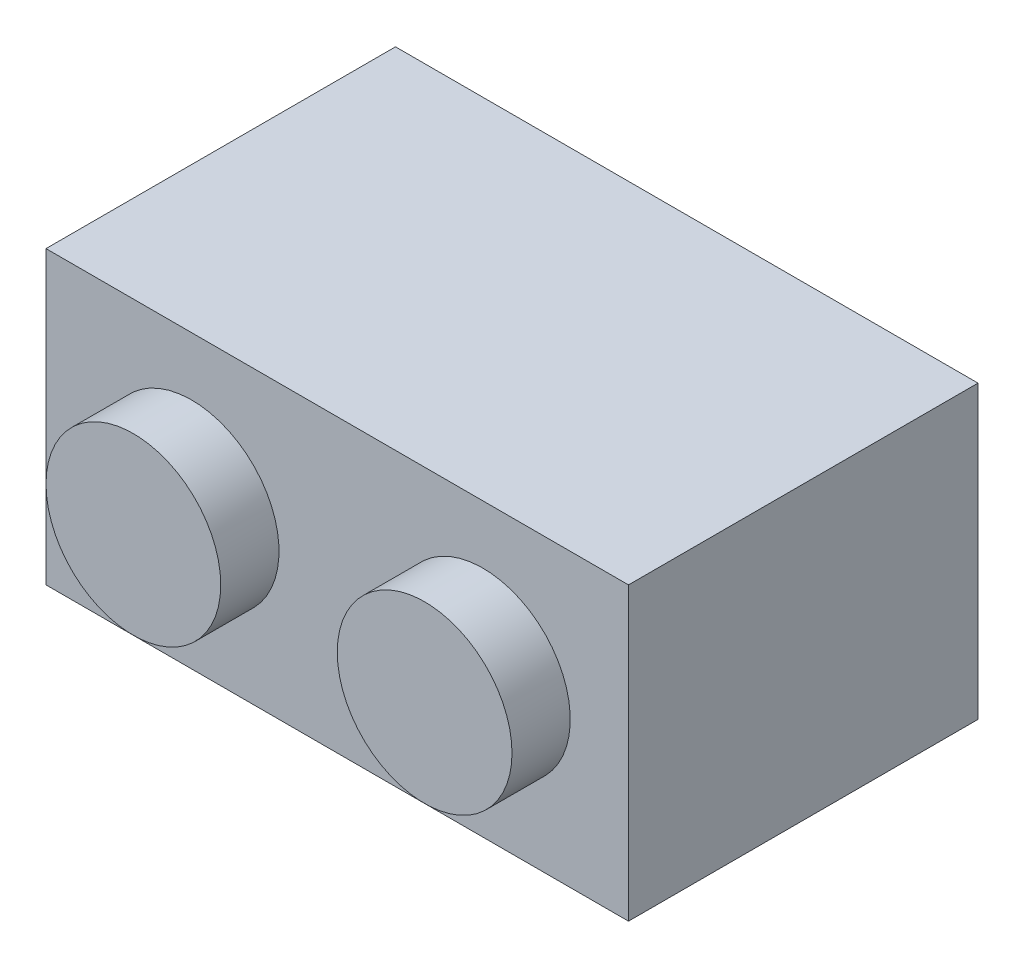
ISO-10303-21;
HEADER;
FILE_DESCRIPTION(('STEP AP214'),'2;1');
FILE_NAME('part.step','',(''),(''),'','','');
FILE_SCHEMA(('AUTOMOTIVE_DESIGN { 1 0 10303 214 1 1 1 1 }'));
ENDSEC;
DATA;
#1=APPLICATION_CONTEXT('core data for automotive mechanical design processes');
#2=APPLICATION_PROTOCOL_DEFINITION('international standard','automotive_design',2000,#1);
#3=PRODUCT_CONTEXT('',#1,'mechanical');
#4=PRODUCT('Part','Part','',(#3));
#5=PRODUCT_RELATED_PRODUCT_CATEGORY('part','',(#4));
#6=PRODUCT_DEFINITION_FORMATION('','',#4);
#7=PRODUCT_DEFINITION_CONTEXT('part definition',#1,'design');
#8=PRODUCT_DEFINITION('design','',#6,#7);
#9=PRODUCT_DEFINITION_SHAPE('','',#8);
#10=(LENGTH_UNIT() NAMED_UNIT(*) SI_UNIT(.MILLI.,.METRE.));
#11=(NAMED_UNIT(*) PLANE_ANGLE_UNIT() SI_UNIT($,.RADIAN.));
#12=(NAMED_UNIT(*) SI_UNIT($,.STERADIAN.) SOLID_ANGLE_UNIT());
#13=UNCERTAINTY_MEASURE_WITH_UNIT(LENGTH_MEASURE(1.E-05),#10,'distance_accuracy_value','');
#14=(GEOMETRIC_REPRESENTATION_CONTEXT(3) GLOBAL_UNCERTAINTY_ASSIGNED_CONTEXT((#13)) GLOBAL_UNIT_ASSIGNED_CONTEXT((#10,
#11,#12)) REPRESENTATION_CONTEXT('',''));
#15=CARTESIAN_POINT('',(0.,0.,0.));
#16=DIRECTION('',(0.,0.,1.));
#17=DIRECTION('',(1.,0.,0.));
#18=AXIS2_PLACEMENT_3D('',#15,#16,#17);
#19=CARTESIAN_POINT('',(0.,0.,7.9375));
#20=DIRECTION('',(0.,0.,-1.));
#21=DIRECTION('',(-1.,0.,0.));
#22=AXIS2_PLACEMENT_3D('',#19,#20,#21);
#23=PLANE('',#22);
#24=CARTESIAN_POINT('',(11.90625,3.96875,7.9375));
#25=DIRECTION('',(0.,0.,-1.));
#26=DIRECTION('',(-1.,0.,0.));
#27=AXIS2_PLACEMENT_3D('',#24,#25,#26);
#28=CIRCLE('',#27,0.793750000000002);
#29=CARTESIAN_POINT('',(11.1125,3.96875,7.9375));
#30=VERTEX_POINT('',#29);
#31=EDGE_CURVE('E132',#30,#30,#28,.F.);
#32=ORIENTED_EDGE('',*,*,#31,.T.);
#33=EDGE_LOOP('',(#32));
#34=FACE_BOUND('',#33,.T.);
#35=DIRECTION('',(0.,1.,0.));
#36=VECTOR('',#35,1.);
#37=CARTESIAN_POINT('',(1.5875,0.,7.9375));
#38=LINE('',#37,#36);
#39=CARTESIAN_POINT('',(1.5875,1.5875,7.9375));
#40=VERTEX_POINT('',#39);
#41=CARTESIAN_POINT('',(1.5875,6.35,7.9375));
#42=VERTEX_POINT('',#41);
#43=EDGE_CURVE('E128',#40,#42,#38,.T.);
#44=ORIENTED_EDGE('',*,*,#43,.T.);
#45=DIRECTION('',(1.,0.,0.));
#46=VECTOR('',#45,1.);
#47=CARTESIAN_POINT('',(0.,6.35,7.9375));
#48=LINE('',#47,#46);
#49=CARTESIAN_POINT('',(14.2875,6.35,7.9375));
#50=VERTEX_POINT('',#49);
#51=EDGE_CURVE('E126',#42,#50,#48,.T.);
#52=ORIENTED_EDGE('',*,*,#51,.T.);
#53=DIRECTION('',(0.,1.,0.));
#54=VECTOR('',#53,1.);
#55=CARTESIAN_POINT('',(14.2875,0.,7.9375));
#56=LINE('',#55,#54);
#57=CARTESIAN_POINT('',(14.2875,1.5875,7.9375));
#58=VERTEX_POINT('',#57);
#59=EDGE_CURVE('E117',#58,#50,#56,.T.);
#60=ORIENTED_EDGE('',*,*,#59,.F.);
#61=DIRECTION('',(1.,0.,0.));
#62=VECTOR('',#61,1.);
#63=CARTESIAN_POINT('',(0.,1.5875,7.9375));
#64=LINE('',#63,#62);
#65=EDGE_CURVE('E106',#40,#58,#64,.T.);
#66=ORIENTED_EDGE('',*,*,#65,.F.);
#67=EDGE_LOOP('',(#44,#52,#60,#66));
#68=FACE_BOUND('',#67,.T.);
#69=CARTESIAN_POINT('',(3.96875,3.96875,7.9375));
#70=DIRECTION('',(0.,0.,-1.));
#71=DIRECTION('',(-1.,0.,0.));
#72=AXIS2_PLACEMENT_3D('',#69,#70,#71);
#73=CIRCLE('',#72,0.793750000000002);
#74=CARTESIAN_POINT('',(3.175,3.96875,7.9375));
#75=VERTEX_POINT('',#74);
#76=EDGE_CURVE('E136',#75,#75,#73,.F.);
#77=ORIENTED_EDGE('',*,*,#76,.T.);
#78=EDGE_LOOP('',(#77));
#79=FACE_BOUND('',#78,.T.);
#80=CARTESIAN_POINT('',(7.9375,3.96875,7.9375));
#81=DIRECTION('',(0.,0.,-1.));
#82=DIRECTION('',(-1.,0.,0.));
#83=AXIS2_PLACEMENT_3D('',#80,#81,#82);
#84=CIRCLE('',#83,1.5875);
#85=CARTESIAN_POINT('',(6.35,3.96875,7.9375));
#86=VERTEX_POINT('',#85);
#87=EDGE_CURVE('E267',#86,#86,#84,.T.);
#88=ORIENTED_EDGE('',*,*,#87,.F.);
#89=EDGE_LOOP('',(#88));
#90=FACE_BOUND('',#89,.T.);
#91=ADVANCED_FACE('F33',(#34,#68,#79,#90),#23,.T.);
#92=CARTESIAN_POINT('',(0.,0.,9.525));
#93=DIRECTION('',(0.,0.,-1.));
#94=DIRECTION('',(-1.,0.,0.));
#95=AXIS2_PLACEMENT_3D('',#92,#93,#94);
#96=PLANE('',#95);
#97=CARTESIAN_POINT('',(3.96875,3.96875,9.525));
#98=DIRECTION('',(0.,0.,-1.));
#99=DIRECTION('',(-1.,0.,0.));
#100=AXIS2_PLACEMENT_3D('',#97,#98,#99);
#101=CIRCLE('',#100,2.38125);
#102=CARTESIAN_POINT('',(1.5875,3.96875,9.525));
#103=VERTEX_POINT('',#102);
#104=EDGE_CURVE('E41',#103,#103,#101,.F.);
#105=ORIENTED_EDGE('',*,*,#104,.F.);
#106=EDGE_LOOP('',(#105));
#107=FACE_BOUND('',#106,.T.);
#108=DIRECTION('',(0.,1.,0.));
#109=VECTOR('',#108,1.);
#110=CARTESIAN_POINT('',(0.,0.,9.525));
#111=LINE('',#110,#109);
#112=CARTESIAN_POINT('',(0.,0.,9.525));
#113=VERTEX_POINT('',#112);
#114=CARTESIAN_POINT('',(0.,7.9375,9.525));
#115=VERTEX_POINT('',#114);
#116=EDGE_CURVE('E162',#113,#115,#111,.T.);
#117=ORIENTED_EDGE('',*,*,#116,.F.);
#118=DIRECTION('',(1.,0.,0.));
#119=VECTOR('',#118,1.);
#120=CARTESIAN_POINT('',(0.,0.,9.525));
#121=LINE('',#120,#119);
#122=CARTESIAN_POINT('',(15.875,0.,9.525));
#123=VERTEX_POINT('',#122);
#124=EDGE_CURVE('E169',#113,#123,#121,.T.);
#125=ORIENTED_EDGE('',*,*,#124,.T.);
#126=DIRECTION('',(0.,1.,0.));
#127=VECTOR('',#126,1.);
#128=CARTESIAN_POINT('',(15.875,0.,9.525));
#129=LINE('',#128,#127);
#130=CARTESIAN_POINT('',(15.875,7.9375,9.525));
#131=VERTEX_POINT('',#130);
#132=EDGE_CURVE('E167',#123,#131,#129,.T.);
#133=ORIENTED_EDGE('',*,*,#132,.T.);
#134=DIRECTION('',(1.,0.,0.));
#135=VECTOR('',#134,1.);
#136=CARTESIAN_POINT('',(0.,7.9375,9.525));
#137=LINE('',#136,#135);
#138=EDGE_CURVE('E164',#115,#131,#137,.T.);
#139=ORIENTED_EDGE('',*,*,#138,.F.);
#140=EDGE_LOOP('',(#117,#125,#133,#139));
#141=FACE_BOUND('',#140,.T.);
#142=CARTESIAN_POINT('',(11.90625,3.96875,9.525));
#143=DIRECTION('',(0.,0.,-1.));
#144=DIRECTION('',(-1.,0.,0.));
#145=AXIS2_PLACEMENT_3D('',#142,#143,#144);
#146=CIRCLE('',#145,2.38125);
#147=CARTESIAN_POINT('',(9.525,3.96875,9.525));
#148=VERTEX_POINT('',#147);
#149=EDGE_CURVE('E11',#148,#148,#146,.F.);
#150=ORIENTED_EDGE('',*,*,#149,.F.);
#151=EDGE_LOOP('',(#150));
#152=FACE_BOUND('',#151,.T.);
#153=ADVANCED_FACE('F191',(#107,#141,#152),#96,.F.);
#154=CARTESIAN_POINT('',(0.,0.,9.525));
#155=DIRECTION('',(-1.,0.,0.));
#156=DIRECTION('',(0.,0.,1.));
#157=AXIS2_PLACEMENT_3D('',#154,#155,#156);
#158=PLANE('',#157);
#159=DIRECTION('',(0.,1.,0.));
#160=VECTOR('',#159,1.);
#161=CARTESIAN_POINT('',(0.,0.,0.));
#162=LINE('',#161,#160);
#163=CARTESIAN_POINT('',(0.,0.,0.));
#164=VERTEX_POINT('',#163);
#165=CARTESIAN_POINT('',(0.,7.9375,0.));
#166=VERTEX_POINT('',#165);
#167=EDGE_CURVE('E161',#164,#166,#162,.T.);
#168=ORIENTED_EDGE('',*,*,#167,.F.);
#169=DIRECTION('',(0.,0.,-1.));
#170=VECTOR('',#169,1.);
#171=CARTESIAN_POINT('',(0.,0.,9.525));
#172=LINE('',#171,#170);
#173=EDGE_CURVE('E57',#113,#164,#172,.T.);
#174=ORIENTED_EDGE('',*,*,#173,.F.);
#175=ORIENTED_EDGE('',*,*,#116,.T.);
#176=DIRECTION('',(0.,0.,-1.));
#177=VECTOR('',#176,1.);
#178=CARTESIAN_POINT('',(0.,7.9375,9.525));
#179=LINE('',#178,#177);
#180=EDGE_CURVE('E82',#115,#166,#179,.T.);
#181=ORIENTED_EDGE('',*,*,#180,.T.);
#182=EDGE_LOOP('',(#168,#174,#175,#181));
#183=FACE_BOUND('',#182,.T.);
#184=ADVANCED_FACE('F35',(#183),#158,.T.);
#185=CARTESIAN_POINT('',(0.,0.,9.525));
#186=DIRECTION('',(0.,1.,0.));
#187=DIRECTION('',(0.,0.,1.));
#188=AXIS2_PLACEMENT_3D('',#185,#186,#187);
#189=PLANE('',#188);
#190=DIRECTION('',(1.,0.,0.));
#191=VECTOR('',#190,1.);
#192=CARTESIAN_POINT('',(0.,0.,0.));
#193=LINE('',#192,#191);
#194=CARTESIAN_POINT('',(15.875,0.,0.));
#195=VERTEX_POINT('',#194);
#196=EDGE_CURVE('E165',#164,#195,#193,.T.);
#197=ORIENTED_EDGE('',*,*,#196,.T.);
#198=DIRECTION('',(0.,0.,-1.));
#199=VECTOR('',#198,1.);
#200=CARTESIAN_POINT('',(15.875,0.,9.525));
#201=LINE('',#200,#199);
#202=EDGE_CURVE('E181',#123,#195,#201,.T.);
#203=ORIENTED_EDGE('',*,*,#202,.F.);
#204=ORIENTED_EDGE('',*,*,#124,.F.);
#205=ORIENTED_EDGE('',*,*,#173,.T.);
#206=EDGE_LOOP('',(#197,#203,#204,#205));
#207=FACE_BOUND('',#206,.T.);
#208=ADVANCED_FACE('F287',(#207),#189,.F.);
#209=CARTESIAN_POINT('',(15.875,0.,9.525));
#210=DIRECTION('',(-1.,0.,0.));
#211=DIRECTION('',(0.,0.,1.));
#212=AXIS2_PLACEMENT_3D('',#209,#210,#211);
#213=PLANE('',#212);
#214=DIRECTION('',(0.,1.,0.));
#215=VECTOR('',#214,1.);
#216=CARTESIAN_POINT('',(15.875,0.,0.));
#217=LINE('',#216,#215);
#218=CARTESIAN_POINT('',(15.875,7.9375,0.));
#219=VERTEX_POINT('',#218);
#220=EDGE_CURVE('E176',#195,#219,#217,.T.);
#221=ORIENTED_EDGE('',*,*,#220,.T.);
#222=DIRECTION('',(0.,0.,-1.));
#223=VECTOR('',#222,1.);
#224=CARTESIAN_POINT('',(15.875,7.9375,9.525));
#225=LINE('',#224,#223);
#226=EDGE_CURVE('E184',#131,#219,#225,.T.);
#227=ORIENTED_EDGE('',*,*,#226,.F.);
#228=ORIENTED_EDGE('',*,*,#132,.F.);
#229=ORIENTED_EDGE('',*,*,#202,.T.);
#230=EDGE_LOOP('',(#221,#227,#228,#229));
#231=FACE_BOUND('',#230,.T.);
#232=ADVANCED_FACE('F285',(#231),#213,.F.);
#233=CARTESIAN_POINT('',(0.,7.9375,9.525));
#234=DIRECTION('',(0.,1.,0.));
#235=DIRECTION('',(0.,0.,1.));
#236=AXIS2_PLACEMENT_3D('',#233,#234,#235);
#237=PLANE('',#236);
#238=DIRECTION('',(1.,0.,0.));
#239=VECTOR('',#238,1.);
#240=CARTESIAN_POINT('',(0.,7.9375,0.));
#241=LINE('',#240,#239);
#242=EDGE_CURVE('E173',#166,#219,#241,.T.);
#243=ORIENTED_EDGE('',*,*,#242,.F.);
#244=ORIENTED_EDGE('',*,*,#180,.F.);
#245=ORIENTED_EDGE('',*,*,#138,.T.);
#246=ORIENTED_EDGE('',*,*,#226,.T.);
#247=EDGE_LOOP('',(#243,#244,#245,#246));
#248=FACE_BOUND('',#247,.T.);
#249=ADVANCED_FACE('F279',(#248),#237,.T.);
#250=CARTESIAN_POINT('',(0.,0.,0.));
#251=DIRECTION('',(0.,0.,-1.));
#252=DIRECTION('',(-1.,0.,0.));
#253=AXIS2_PLACEMENT_3D('',#250,#251,#252);
#254=PLANE('',#253);
#255=DIRECTION('',(0.,1.,0.));
#256=VECTOR('',#255,1.);
#257=CARTESIAN_POINT('',(1.5875,0.,0.));
#258=LINE('',#257,#256);
#259=CARTESIAN_POINT('',(1.5875,1.5875,0.));
#260=VERTEX_POINT('',#259);
#261=CARTESIAN_POINT('',(1.5875,6.35,0.));
#262=VERTEX_POINT('',#261);
#263=EDGE_CURVE('E143',#260,#262,#258,.T.);
#264=ORIENTED_EDGE('',*,*,#263,.F.);
#265=DIRECTION('',(1.,0.,0.));
#266=VECTOR('',#265,1.);
#267=CARTESIAN_POINT('',(0.,1.5875,0.));
#268=LINE('',#267,#266);
#269=CARTESIAN_POINT('',(14.2875,1.5875,0.));
#270=VERTEX_POINT('',#269);
#271=EDGE_CURVE('E154',#260,#270,#268,.T.);
#272=ORIENTED_EDGE('',*,*,#271,.T.);
#273=DIRECTION('',(0.,1.,0.));
#274=VECTOR('',#273,1.);
#275=CARTESIAN_POINT('',(14.2875,0.,0.));
#276=LINE('',#275,#274);
#277=CARTESIAN_POINT('',(14.2875,6.35,0.));
#278=VERTEX_POINT('',#277);
#279=EDGE_CURVE('E48',#270,#278,#276,.T.);
#280=ORIENTED_EDGE('',*,*,#279,.T.);
#281=DIRECTION('',(1.,0.,0.));
#282=VECTOR('',#281,1.);
#283=CARTESIAN_POINT('',(0.,6.35,0.));
#284=LINE('',#283,#282);
#285=EDGE_CURVE('E150',#262,#278,#284,.T.);
#286=ORIENTED_EDGE('',*,*,#285,.F.);
#287=EDGE_LOOP('',(#264,#272,#280,#286));
#288=FACE_BOUND('',#287,.T.);
#289=ORIENTED_EDGE('',*,*,#167,.T.);
#290=ORIENTED_EDGE('',*,*,#242,.T.);
#291=ORIENTED_EDGE('',*,*,#220,.F.);
#292=ORIENTED_EDGE('',*,*,#196,.F.);
#293=EDGE_LOOP('',(#289,#290,#291,#292));
#294=FACE_BOUND('',#293,.T.);
#295=ADVANCED_FACE('F276',(#288,#294),#254,.T.);
#296=CARTESIAN_POINT('',(3.96875,3.96875,11.1125));
#297=DIRECTION('',(0.,0.,-1.));
#298=DIRECTION('',(-1.,0.,0.));
#299=AXIS2_PLACEMENT_3D('',#296,#297,#298);
#300=CYLINDRICAL_SURFACE('',#299,2.38125);
#301=CARTESIAN_POINT('',(3.96875,3.96875,11.1125));
#302=DIRECTION('',(0.,0.,1.));
#303=DIRECTION('',(1.,0.,0.));
#304=AXIS2_PLACEMENT_3D('',#301,#302,#303);
#305=CIRCLE('',#304,2.38125);
#306=CARTESIAN_POINT('',(6.35,3.96875,11.1125));
#307=VERTEX_POINT('',#306);
#308=EDGE_CURVE('E158',#307,#307,#305,.T.);
#309=ORIENTED_EDGE('',*,*,#308,.F.);
#310=EDGE_LOOP('',(#309));
#311=FACE_BOUND('',#310,.T.);
#312=ORIENTED_EDGE('',*,*,#104,.T.);
#313=EDGE_LOOP('',(#312));
#314=FACE_BOUND('',#313,.T.);
#315=ADVANCED_FACE('F189',(#311,#314),#300,.T.);
#316=CARTESIAN_POINT('',(3.96875,3.96875,11.1125));
#317=DIRECTION('',(0.,0.,1.));
#318=DIRECTION('',(1.,0.,0.));
#319=AXIS2_PLACEMENT_3D('',#316,#317,#318);
#320=PLANE('',#319);
#321=ORIENTED_EDGE('',*,*,#308,.T.);
#322=EDGE_LOOP('',(#321));
#323=FACE_BOUND('',#322,.T.);
#324=ADVANCED_FACE('F202',(#323),#320,.T.);
#325=CARTESIAN_POINT('',(11.90625,3.96875,11.1125));
#326=DIRECTION('',(0.,0.,-1.));
#327=DIRECTION('',(-1.,0.,0.));
#328=AXIS2_PLACEMENT_3D('',#325,#326,#327);
#329=CYLINDRICAL_SURFACE('',#328,2.38125);
#330=CARTESIAN_POINT('',(11.90625,3.96875,11.1125));
#331=DIRECTION('',(0.,0.,1.));
#332=DIRECTION('',(1.,0.,0.));
#333=AXIS2_PLACEMENT_3D('',#330,#331,#332);
#334=CIRCLE('',#333,2.38125);
#335=CARTESIAN_POINT('',(14.2875,3.96875,11.1125));
#336=VERTEX_POINT('',#335);
#337=EDGE_CURVE('E135',#336,#336,#334,.T.);
#338=ORIENTED_EDGE('',*,*,#337,.F.);
#339=EDGE_LOOP('',(#338));
#340=FACE_BOUND('',#339,.T.);
#341=ORIENTED_EDGE('',*,*,#149,.T.);
#342=EDGE_LOOP('',(#341));
#343=FACE_BOUND('',#342,.T.);
#344=ADVANCED_FACE('F199',(#340,#343),#329,.T.);
#345=CARTESIAN_POINT('',(11.90625,3.96875,11.1125));
#346=DIRECTION('',(0.,0.,1.));
#347=DIRECTION('',(1.,0.,0.));
#348=AXIS2_PLACEMENT_3D('',#345,#346,#347);
#349=PLANE('',#348);
#350=ORIENTED_EDGE('',*,*,#337,.T.);
#351=EDGE_LOOP('',(#350));
#352=FACE_BOUND('',#351,.T.);
#353=ADVANCED_FACE('F201',(#352),#349,.T.);
#354=CARTESIAN_POINT('',(1.5875,0.,9.525));
#355=DIRECTION('',(-1.,0.,0.));
#356=DIRECTION('',(0.,0.,1.));
#357=AXIS2_PLACEMENT_3D('',#354,#355,#356);
#358=PLANE('',#357);
#359=ORIENTED_EDGE('',*,*,#263,.T.);
#360=DIRECTION('',(0.,0.,-1.));
#361=VECTOR('',#360,1.);
#362=CARTESIAN_POINT('',(1.5875,6.35,9.525));
#363=LINE('',#362,#361);
#364=EDGE_CURVE('E116',#42,#262,#363,.T.);
#365=ORIENTED_EDGE('',*,*,#364,.F.);
#366=ORIENTED_EDGE('',*,*,#43,.F.);
#367=DIRECTION('',(0.,0.,-1.));
#368=VECTOR('',#367,1.);
#369=CARTESIAN_POINT('',(1.5875,1.5875,9.525));
#370=LINE('',#369,#368);
#371=EDGE_CURVE('E111',#40,#260,#370,.T.);
#372=ORIENTED_EDGE('',*,*,#371,.T.);
#373=EDGE_LOOP('',(#359,#365,#366,#372));
#374=FACE_BOUND('',#373,.T.);
#375=ADVANCED_FACE('F209',(#374),#358,.F.);
#376=CARTESIAN_POINT('',(0.,1.5875,9.525));
#377=DIRECTION('',(0.,1.,0.));
#378=DIRECTION('',(0.,0.,1.));
#379=AXIS2_PLACEMENT_3D('',#376,#377,#378);
#380=PLANE('',#379);
#381=ORIENTED_EDGE('',*,*,#271,.F.);
#382=ORIENTED_EDGE('',*,*,#371,.F.);
#383=ORIENTED_EDGE('',*,*,#65,.T.);
#384=DIRECTION('',(0.,0.,-1.));
#385=VECTOR('',#384,1.);
#386=CARTESIAN_POINT('',(14.2875,1.5875,9.525));
#387=LINE('',#386,#385);
#388=EDGE_CURVE('E109',#58,#270,#387,.T.);
#389=ORIENTED_EDGE('',*,*,#388,.T.);
#390=EDGE_LOOP('',(#381,#382,#383,#389));
#391=FACE_BOUND('',#390,.T.);
#392=ADVANCED_FACE('F108',(#391),#380,.T.);
#393=CARTESIAN_POINT('',(14.2875,0.,9.525));
#394=DIRECTION('',(-1.,0.,0.));
#395=DIRECTION('',(0.,0.,1.));
#396=AXIS2_PLACEMENT_3D('',#393,#394,#395);
#397=PLANE('',#396);
#398=ORIENTED_EDGE('',*,*,#279,.F.);
#399=ORIENTED_EDGE('',*,*,#388,.F.);
#400=ORIENTED_EDGE('',*,*,#59,.T.);
#401=DIRECTION('',(0.,0.,-1.));
#402=VECTOR('',#401,1.);
#403=CARTESIAN_POINT('',(14.2875,6.35,9.525));
#404=LINE('',#403,#402);
#405=EDGE_CURVE('E121',#50,#278,#404,.T.);
#406=ORIENTED_EDGE('',*,*,#405,.T.);
#407=EDGE_LOOP('',(#398,#399,#400,#406));
#408=FACE_BOUND('',#407,.T.);
#409=ADVANCED_FACE('F119',(#408),#397,.T.);
#410=CARTESIAN_POINT('',(0.,6.35,9.525));
#411=DIRECTION('',(0.,1.,0.));
#412=DIRECTION('',(0.,0.,1.));
#413=AXIS2_PLACEMENT_3D('',#410,#411,#412);
#414=PLANE('',#413);
#415=ORIENTED_EDGE('',*,*,#285,.T.);
#416=ORIENTED_EDGE('',*,*,#405,.F.);
#417=ORIENTED_EDGE('',*,*,#51,.F.);
#418=ORIENTED_EDGE('',*,*,#364,.T.);
#419=EDGE_LOOP('',(#415,#416,#417,#418));
#420=FACE_BOUND('',#419,.T.);
#421=ADVANCED_FACE('F231',(#420),#414,.F.);
#422=CARTESIAN_POINT('',(3.96875,3.96875,11.1125));
#423=DIRECTION('',(0.,0.,-1.));
#424=DIRECTION('',(-1.,0.,0.));
#425=AXIS2_PLACEMENT_3D('',#422,#423,#424);
#426=CYLINDRICAL_SURFACE('',#425,0.793750000000002);
#427=CARTESIAN_POINT('',(3.96875,3.96875,9.525));
#428=DIRECTION('',(0.,0.,1.));
#429=DIRECTION('',(1.,0.,0.));
#430=AXIS2_PLACEMENT_3D('',#427,#428,#429);
#431=CIRCLE('',#430,0.793750000000002);
#432=CARTESIAN_POINT('',(4.7625,3.96875,9.525));
#433=VERTEX_POINT('',#432);
#434=EDGE_CURVE('E140',#433,#433,#431,.T.);
#435=ORIENTED_EDGE('',*,*,#434,.T.);
#436=EDGE_LOOP('',(#435));
#437=FACE_BOUND('',#436,.T.);
#438=ORIENTED_EDGE('',*,*,#76,.F.);
#439=EDGE_LOOP('',(#438));
#440=FACE_BOUND('',#439,.T.);
#441=ADVANCED_FACE('F234',(#437,#440),#426,.F.);
#442=CARTESIAN_POINT('',(3.96875,3.96875,9.525));
#443=DIRECTION('',(0.,0.,1.));
#444=DIRECTION('',(1.,0.,0.));
#445=AXIS2_PLACEMENT_3D('',#442,#443,#444);
#446=PLANE('',#445);
#447=ORIENTED_EDGE('',*,*,#434,.F.);
#448=EDGE_LOOP('',(#447));
#449=FACE_BOUND('',#448,.T.);
#450=ADVANCED_FACE('F238',(#449),#446,.F.);
#451=CARTESIAN_POINT('',(11.90625,3.96875,11.1125));
#452=DIRECTION('',(0.,0.,-1.));
#453=DIRECTION('',(-1.,0.,0.));
#454=AXIS2_PLACEMENT_3D('',#451,#452,#453);
#455=CYLINDRICAL_SURFACE('',#454,0.793750000000002);
#456=CARTESIAN_POINT('',(11.90625,3.96875,9.525));
#457=DIRECTION('',(0.,0.,1.));
#458=DIRECTION('',(1.,0.,0.));
#459=AXIS2_PLACEMENT_3D('',#456,#457,#458);
#460=CIRCLE('',#459,0.793750000000002);
#461=CARTESIAN_POINT('',(12.7,3.96875,9.525));
#462=VERTEX_POINT('',#461);
#463=EDGE_CURVE('E144',#462,#462,#460,.T.);
#464=ORIENTED_EDGE('',*,*,#463,.T.);
#465=EDGE_LOOP('',(#464));
#466=FACE_BOUND('',#465,.T.);
#467=ORIENTED_EDGE('',*,*,#31,.F.);
#468=EDGE_LOOP('',(#467));
#469=FACE_BOUND('',#468,.T.);
#470=ADVANCED_FACE('F242',(#466,#469),#455,.F.);
#471=CARTESIAN_POINT('',(11.90625,3.96875,9.525));
#472=DIRECTION('',(0.,0.,1.));
#473=DIRECTION('',(1.,0.,0.));
#474=AXIS2_PLACEMENT_3D('',#471,#472,#473);
#475=PLANE('',#474);
#476=ORIENTED_EDGE('',*,*,#463,.F.);
#477=EDGE_LOOP('',(#476));
#478=FACE_BOUND('',#477,.T.);
#479=ADVANCED_FACE('F246',(#478),#475,.F.);
#480=CARTESIAN_POINT('',(7.9375,3.96875,0.));
#481=DIRECTION('',(0.,0.,1.));
#482=DIRECTION('',(1.,0.,0.));
#483=AXIS2_PLACEMENT_3D('',#480,#481,#482);
#484=CYLINDRICAL_SURFACE('',#483,1.5875);
#485=CARTESIAN_POINT('',(7.9375,3.96875,0.));
#486=DIRECTION('',(0.,0.,-1.));
#487=DIRECTION('',(-1.,0.,0.));
#488=AXIS2_PLACEMENT_3D('',#485,#486,#487);
#489=CIRCLE('',#488,1.5875);
#490=CARTESIAN_POINT('',(6.35,3.96875,0.));
#491=VERTEX_POINT('',#490);
#492=EDGE_CURVE('E147',#491,#491,#489,.T.);
#493=ORIENTED_EDGE('',*,*,#492,.F.);
#494=EDGE_LOOP('',(#493));
#495=FACE_BOUND('',#494,.T.);
#496=ORIENTED_EDGE('',*,*,#87,.T.);
#497=EDGE_LOOP('',(#496));
#498=FACE_BOUND('',#497,.T.);
#499=ADVANCED_FACE('F222',(#495,#498),#484,.T.);
#500=CARTESIAN_POINT('',(7.9375,3.96875,0.));
#501=DIRECTION('',(0.,0.,-1.));
#502=DIRECTION('',(-1.,0.,0.));
#503=AXIS2_PLACEMENT_3D('',#500,#501,#502);
#504=PLANE('',#503);
#505=ORIENTED_EDGE('',*,*,#492,.T.);
#506=EDGE_LOOP('',(#505));
#507=FACE_BOUND('',#506,.T.);
#508=ADVANCED_FACE('F253',(#507),#504,.T.);
#509=CLOSED_SHELL('',(#91,#153,#184,#208,#232,#249,#295,#315,#324,#344,#353,#375,#392,#409,#421,
#441,#450,#470,#479,#499,#508));
#510=MANIFOLD_SOLID_BREP('B2',#509);
#511=ADVANCED_BREP_SHAPE_REPRESENTATION('',(#18,#510),#14);
#512=SHAPE_DEFINITION_REPRESENTATION(#9,#511);
ENDSEC;
END-ISO-10303-21;
